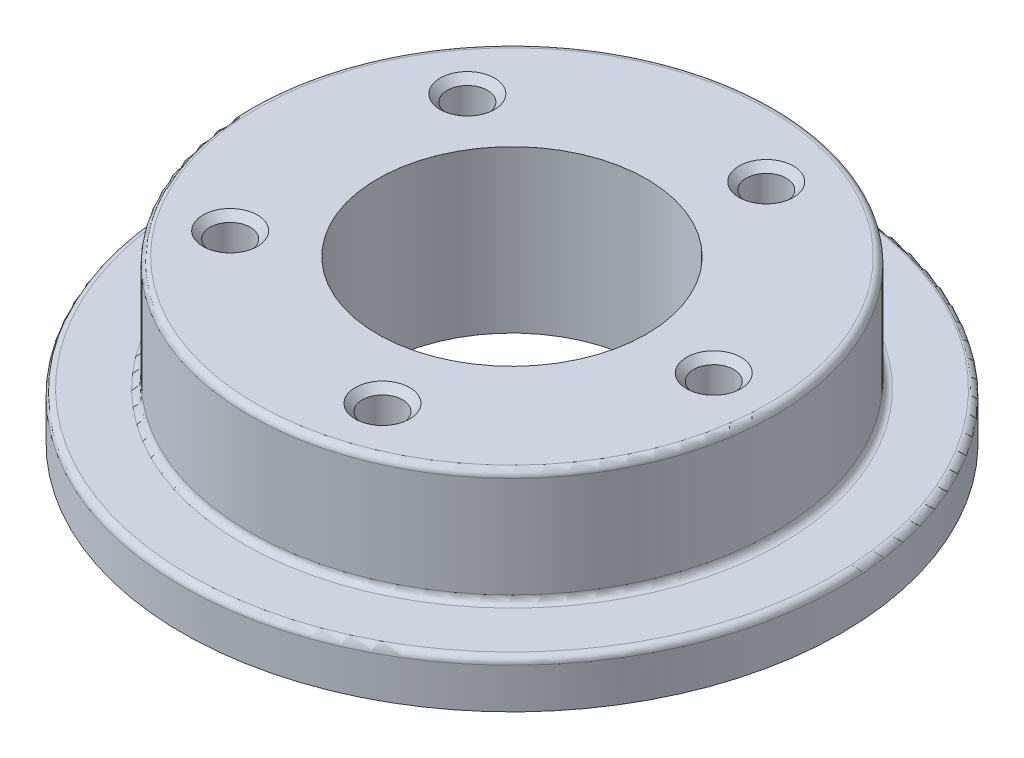
ISO-10303-21;
HEADER;
FILE_DESCRIPTION(('STEP AP214'),'2;1');
FILE_NAME('part.step','',(''),(''),'','','');
FILE_SCHEMA(('AUTOMOTIVE_DESIGN { 1 0 10303 214 1 1 1 1 }'));
ENDSEC;
DATA;
#1=APPLICATION_CONTEXT('core data for automotive mechanical design processes');
#2=APPLICATION_PROTOCOL_DEFINITION('international standard','automotive_design',2000,#1);
#3=PRODUCT_CONTEXT('',#1,'mechanical');
#4=PRODUCT('Part','Part','',(#3));
#5=PRODUCT_RELATED_PRODUCT_CATEGORY('part','',(#4));
#6=PRODUCT_DEFINITION_FORMATION('','',#4);
#7=PRODUCT_DEFINITION_CONTEXT('part definition',#1,'design');
#8=PRODUCT_DEFINITION('design','',#6,#7);
#9=PRODUCT_DEFINITION_SHAPE('','',#8);
#10=(LENGTH_UNIT() NAMED_UNIT(*) SI_UNIT(.MILLI.,.METRE.));
#11=(NAMED_UNIT(*) PLANE_ANGLE_UNIT() SI_UNIT($,.RADIAN.));
#12=(NAMED_UNIT(*) SI_UNIT($,.STERADIAN.) SOLID_ANGLE_UNIT());
#13=UNCERTAINTY_MEASURE_WITH_UNIT(LENGTH_MEASURE(1.E-05),#10,'distance_accuracy_value','');
#14=(GEOMETRIC_REPRESENTATION_CONTEXT(3) GLOBAL_UNCERTAINTY_ASSIGNED_CONTEXT((#13)) GLOBAL_UNIT_ASSIGNED_CONTEXT((#10,
#11,#12)) REPRESENTATION_CONTEXT('',''));
#15=CARTESIAN_POINT('',(0.,0.,0.));
#16=DIRECTION('',(0.,0.,1.));
#17=DIRECTION('',(1.,0.,0.));
#18=AXIS2_PLACEMENT_3D('',#15,#16,#17);
#19=CARTESIAN_POINT('',(0.,3.5,0.));
#20=DIRECTION('',(0.,1.,0.));
#21=DIRECTION('',(1.,0.,0.));
#22=AXIS2_PLACEMENT_3D('',#19,#20,#21);
#23=PLANE('',#22);
#24=CARTESIAN_POINT('',(0.,3.5,0.));
#25=DIRECTION('',(0.,1.,0.));
#26=DIRECTION('',(0.,0.,1.));
#27=AXIS2_PLACEMENT_3D('',#24,#25,#26);
#28=CIRCLE('',#27,20.);
#29=CARTESIAN_POINT('',(0.,3.5,20.));
#30=VERTEX_POINT('',#29);
#31=EDGE_CURVE('E59',#30,#30,#28,.F.);
#32=ORIENTED_EDGE('',*,*,#31,.T.);
#33=EDGE_LOOP('',(#32));
#34=FACE_BOUND('',#33,.T.);
#35=CARTESIAN_POINT('',(0.,3.5,0.));
#36=DIRECTION('',(0.,1.,0.));
#37=DIRECTION('',(0.,0.,1.));
#38=AXIS2_PLACEMENT_3D('',#35,#36,#37);
#39=CIRCLE('',#38,24.);
#40=CARTESIAN_POINT('',(0.,3.5,24.));
#41=VERTEX_POINT('',#40);
#42=EDGE_CURVE('E166',#41,#41,#39,.T.);
#43=ORIENTED_EDGE('',*,*,#42,.T.);
#44=EDGE_LOOP('',(#43));
#45=FACE_BOUND('',#44,.T.);
#46=ADVANCED_FACE('F50',(#34,#45),#23,.T.);
#47=CARTESIAN_POINT('',(0.,0.,0.));
#48=DIRECTION('',(0.,1.,0.));
#49=DIRECTION('',(1.,0.,0.));
#50=AXIS2_PLACEMENT_3D('',#47,#48,#49);
#51=PLANE('',#50);
#52=CARTESIAN_POINT('',(0.,0.,0.));
#53=DIRECTION('',(0.,1.,0.));
#54=DIRECTION('',(1.,0.,0.));
#55=AXIS2_PLACEMENT_3D('',#52,#53,#54);
#56=CIRCLE('',#55,10.);
#57=CARTESIAN_POINT('',(10.,0.,0.));
#58=VERTEX_POINT('',#57);
#59=EDGE_CURVE('E147',#58,#58,#56,.T.);
#60=ORIENTED_EDGE('',*,*,#59,.T.);
#61=EDGE_LOOP('',(#60));
#62=FACE_BOUND('',#61,.T.);
#63=CARTESIAN_POINT('',(0.,0.,0.));
#64=DIRECTION('',(0.,1.,0.));
#65=DIRECTION('',(1.,0.,0.));
#66=AXIS2_PLACEMENT_3D('',#63,#64,#65);
#67=CIRCLE('',#66,24.5);
#68=CARTESIAN_POINT('',(24.5,0.,0.));
#69=VERTEX_POINT('',#68);
#70=EDGE_CURVE('E151',#69,#69,#67,.T.);
#71=ORIENTED_EDGE('',*,*,#70,.F.);
#72=EDGE_LOOP('',(#71));
#73=FACE_BOUND('',#72,.T.);
#74=ADVANCED_FACE('F189',(#62,#73),#51,.F.);
#75=CARTESIAN_POINT('',(0.,3.5,0.));
#76=DIRECTION('',(0.,-1.,0.));
#77=DIRECTION('',(0.,0.,-1.));
#78=AXIS2_PLACEMENT_3D('',#75,#76,#77);
#79=CYLINDRICAL_SURFACE('',#78,24.5);
#80=CARTESIAN_POINT('',(0.,3.,0.));
#81=DIRECTION('',(0.,1.,0.));
#82=DIRECTION('',(0.,0.,1.));
#83=AXIS2_PLACEMENT_3D('',#80,#81,#82);
#84=CIRCLE('',#83,24.5);
#85=CARTESIAN_POINT('',(0.,3.,24.5));
#86=VERTEX_POINT('',#85);
#87=EDGE_CURVE('E12',#86,#86,#84,.F.);
#88=ORIENTED_EDGE('',*,*,#87,.T.);
#89=EDGE_LOOP('',(#88));
#90=FACE_BOUND('',#89,.T.);
#91=ORIENTED_EDGE('',*,*,#70,.T.);
#92=EDGE_LOOP('',(#91));
#93=FACE_BOUND('',#92,.T.);
#94=ADVANCED_FACE('F194',(#90,#93),#79,.T.);
#95=CARTESIAN_POINT('',(0.,3.5,0.));
#96=DIRECTION('',(0.,-1.,0.));
#97=DIRECTION('',(0.,0.,-1.));
#98=AXIS2_PLACEMENT_3D('',#95,#96,#97);
#99=CYLINDRICAL_SURFACE('',#98,10.);
#100=ORIENTED_EDGE('',*,*,#59,.F.);
#101=EDGE_LOOP('',(#100));
#102=FACE_BOUND('',#101,.T.);
#103=CARTESIAN_POINT('',(0.,12.,0.));
#104=DIRECTION('',(0.,1.,0.));
#105=DIRECTION('',(1.,0.,0.));
#106=AXIS2_PLACEMENT_3D('',#103,#104,#105);
#107=CIRCLE('',#106,10.);
#108=CARTESIAN_POINT('',(10.,12.,0.));
#109=VERTEX_POINT('',#108);
#110=EDGE_CURVE('E143',#109,#109,#107,.T.);
#111=ORIENTED_EDGE('',*,*,#110,.T.);
#112=EDGE_LOOP('',(#111));
#113=FACE_BOUND('',#112,.T.);
#114=ADVANCED_FACE('F198',(#102,#113),#99,.F.);
#115=CARTESIAN_POINT('',(0.,12.,0.));
#116=DIRECTION('',(0.,1.,0.));
#117=DIRECTION('',(1.,0.,0.));
#118=AXIS2_PLACEMENT_3D('',#115,#116,#117);
#119=PLANE('',#118);
#120=CARTESIAN_POINT('',(0.,12.,0.));
#121=DIRECTION('',(0.,1.,0.));
#122=DIRECTION('',(0.,0.,1.));
#123=AXIS2_PLACEMENT_3D('',#120,#121,#122);
#124=CIRCLE('',#123,19.);
#125=CARTESIAN_POINT('',(0.,12.,19.));
#126=VERTEX_POINT('',#125);
#127=EDGE_CURVE('E154',#126,#126,#124,.T.);
#128=ORIENTED_EDGE('',*,*,#127,.T.);
#129=EDGE_LOOP('',(#128));
#130=FACE_BOUND('',#129,.T.);
#131=CARTESIAN_POINT('',(4.63525491562437,12.,-14.2658477444273));
#132=DIRECTION('',(0.,1.,0.));
#133=DIRECTION('',(0.,0.,1.));
#134=AXIS2_PLACEMENT_3D('',#131,#132,#133);
#135=CIRCLE('',#134,2.025);
#136=CARTESIAN_POINT('',(4.63525491562437,12.,-12.2408477444273));
#137=VERTEX_POINT('',#136);
#138=EDGE_CURVE('E97',#137,#137,#135,.T.);
#139=ORIENTED_EDGE('',*,*,#138,.F.);
#140=EDGE_LOOP('',(#139));
#141=FACE_BOUND('',#140,.T.);
#142=CARTESIAN_POINT('',(-12.1352549156241,12.,-8.8167787843872));
#143=DIRECTION('',(0.,1.,0.));
#144=DIRECTION('',(0.,0.,1.));
#145=AXIS2_PLACEMENT_3D('',#142,#143,#144);
#146=CIRCLE('',#145,2.025);
#147=CARTESIAN_POINT('',(-12.1352549156241,12.,-6.7917787843872));
#148=VERTEX_POINT('',#147);
#149=EDGE_CURVE('E86',#148,#148,#146,.T.);
#150=ORIENTED_EDGE('',*,*,#149,.F.);
#151=EDGE_LOOP('',(#150));
#152=FACE_BOUND('',#151,.T.);
#153=CARTESIAN_POINT('',(-12.1352549156243,12.,8.81677878438703));
#154=DIRECTION('',(0.,1.,0.));
#155=DIRECTION('',(0.,0.,1.));
#156=AXIS2_PLACEMENT_3D('',#153,#154,#155);
#157=CIRCLE('',#156,2.025);
#158=CARTESIAN_POINT('',(-12.1352549156243,12.,10.841778784387));
#159=VERTEX_POINT('',#158);
#160=EDGE_CURVE('E108',#159,#159,#157,.T.);
#161=ORIENTED_EDGE('',*,*,#160,.F.);
#162=EDGE_LOOP('',(#161));
#163=FACE_BOUND('',#162,.T.);
#164=CARTESIAN_POINT('',(4.63525491562417,12.,14.2658477444273));
#165=DIRECTION('',(0.,1.,0.));
#166=DIRECTION('',(0.,0.,1.));
#167=AXIS2_PLACEMENT_3D('',#164,#165,#166);
#168=CIRCLE('',#167,2.025);
#169=CARTESIAN_POINT('',(4.63525491562417,12.,16.2908477444273));
#170=VERTEX_POINT('',#169);
#171=EDGE_CURVE('E120',#170,#170,#168,.T.);
#172=ORIENTED_EDGE('',*,*,#171,.F.);
#173=EDGE_LOOP('',(#172));
#174=FACE_BOUND('',#173,.T.);
#175=CARTESIAN_POINT('',(15.,12.,0.));
#176=DIRECTION('',(0.,1.,0.));
#177=DIRECTION('',(0.,0.,1.));
#178=AXIS2_PLACEMENT_3D('',#175,#176,#177);
#179=CIRCLE('',#178,2.025);
#180=CARTESIAN_POINT('',(15.,12.,2.025));
#181=VERTEX_POINT('',#180);
#182=EDGE_CURVE('E131',#181,#181,#179,.T.);
#183=ORIENTED_EDGE('',*,*,#182,.F.);
#184=EDGE_LOOP('',(#183));
#185=FACE_BOUND('',#184,.T.);
#186=ORIENTED_EDGE('',*,*,#110,.F.);
#187=EDGE_LOOP('',(#186));
#188=FACE_BOUND('',#187,.T.);
#189=ADVANCED_FACE('F206',(#130,#141,#152,#163,#174,#185,#188),#119,.T.);
#190=CARTESIAN_POINT('',(0.,12.,0.));
#191=DIRECTION('',(0.,-1.,0.));
#192=DIRECTION('',(0.,0.,-1.));
#193=AXIS2_PLACEMENT_3D('',#190,#191,#192);
#194=CYLINDRICAL_SURFACE('',#193,19.5);
#195=CARTESIAN_POINT('',(0.,11.5,0.));
#196=DIRECTION('',(0.,1.,0.));
#197=DIRECTION('',(0.,0.,1.));
#198=AXIS2_PLACEMENT_3D('',#195,#196,#197);
#199=CIRCLE('',#198,19.5);
#200=CARTESIAN_POINT('',(0.,11.5,19.5));
#201=VERTEX_POINT('',#200);
#202=EDGE_CURVE('E162',#201,#201,#199,.F.);
#203=ORIENTED_EDGE('',*,*,#202,.T.);
#204=EDGE_LOOP('',(#203));
#205=FACE_BOUND('',#204,.T.);
#206=CARTESIAN_POINT('',(0.,4.,0.));
#207=DIRECTION('',(0.,1.,0.));
#208=DIRECTION('',(0.,0.,1.));
#209=AXIS2_PLACEMENT_3D('',#206,#207,#208);
#210=CIRCLE('',#209,19.5);
#211=CARTESIAN_POINT('',(0.,4.,19.5));
#212=VERTEX_POINT('',#211);
#213=EDGE_CURVE('E158',#212,#212,#210,.T.);
#214=ORIENTED_EDGE('',*,*,#213,.T.);
#215=EDGE_LOOP('',(#214));
#216=FACE_BOUND('',#215,.T.);
#217=ADVANCED_FACE('F217',(#205,#216),#194,.T.);
#218=CARTESIAN_POINT('',(15.,2.00000000000001,0.));
#219=DIRECTION('',(0.,1.,0.));
#220=DIRECTION('',(0.,0.,1.));
#221=AXIS2_PLACEMENT_3D('',#218,#219,#220);
#222=CONICAL_SURFACE('',#221,1.49999999999999,1.02974425867665);
#223=CARTESIAN_POINT('',(15.,1.09870907145867,0.));
#224=VERTEX_POINT('',#223);
#225=VERTEX_LOOP('',#224);
#226=FACE_BOUND('',#225,.T.);
#227=CARTESIAN_POINT('',(15.,2.00000000000001,0.));
#228=DIRECTION('',(0.,1.,0.));
#229=DIRECTION('',(0.,0.,1.));
#230=AXIS2_PLACEMENT_3D('',#227,#228,#229);
#231=CIRCLE('',#230,1.49999999999999);
#232=CARTESIAN_POINT('',(15.,2.00000000000001,1.49999999999999));
#233=VERTEX_POINT('',#232);
#234=EDGE_CURVE('E139',#233,#233,#231,.T.);
#235=ORIENTED_EDGE('',*,*,#234,.T.);
#236=EDGE_LOOP('',(#235));
#237=FACE_BOUND('',#236,.T.);
#238=ADVANCED_FACE('F227',(#226,#237),#222,.F.);
#239=CARTESIAN_POINT('',(15.,12.,0.));
#240=DIRECTION('',(0.,1.,0.));
#241=DIRECTION('',(0.,0.,1.));
#242=AXIS2_PLACEMENT_3D('',#239,#240,#241);
#243=CYLINDRICAL_SURFACE('',#242,1.49999999999999);
#244=ORIENTED_EDGE('',*,*,#234,.F.);
#245=EDGE_LOOP('',(#244));
#246=FACE_BOUND('',#245,.T.);
#247=CARTESIAN_POINT('',(15.,11.475,0.));
#248=DIRECTION('',(0.,1.,0.));
#249=DIRECTION('',(0.,0.,1.));
#250=AXIS2_PLACEMENT_3D('',#247,#248,#249);
#251=CIRCLE('',#250,1.5);
#252=CARTESIAN_POINT('',(15.,11.475,1.5));
#253=VERTEX_POINT('',#252);
#254=EDGE_CURVE('E135',#253,#253,#251,.T.);
#255=ORIENTED_EDGE('',*,*,#254,.T.);
#256=EDGE_LOOP('',(#255));
#257=FACE_BOUND('',#256,.T.);
#258=ADVANCED_FACE('F233',(#246,#257),#243,.F.);
#259=CARTESIAN_POINT('',(15.,12.,0.));
#260=DIRECTION('',(0.,1.,0.));
#261=DIRECTION('',(0.,0.,1.));
#262=AXIS2_PLACEMENT_3D('',#259,#260,#261);
#263=CONICAL_SURFACE('',#262,2.025,0.78539816339745);
#264=ORIENTED_EDGE('',*,*,#254,.F.);
#265=EDGE_LOOP('',(#264));
#266=FACE_BOUND('',#265,.T.);
#267=ORIENTED_EDGE('',*,*,#182,.T.);
#268=EDGE_LOOP('',(#267));
#269=FACE_BOUND('',#268,.T.);
#270=ADVANCED_FACE('F236',(#266,#269),#263,.F.);
#271=CARTESIAN_POINT('',(4.63525491562417,2.00000000000001,14.2658477444273));
#272=DIRECTION('',(0.,1.,0.));
#273=DIRECTION('',(0.,0.,1.));
#274=AXIS2_PLACEMENT_3D('',#271,#272,#273);
#275=CONICAL_SURFACE('',#274,1.49999999999999,1.02974425867665);
#276=CARTESIAN_POINT('',(4.63525491562417,1.09870907145867,14.2658477444273));
#277=VERTEX_POINT('',#276);
#278=VERTEX_LOOP('',#277);
#279=FACE_BOUND('',#278,.T.);
#280=CARTESIAN_POINT('',(4.63525491562417,2.00000000000001,14.2658477444273));
#281=DIRECTION('',(0.,1.,0.));
#282=DIRECTION('',(0.,0.,1.));
#283=AXIS2_PLACEMENT_3D('',#280,#281,#282);
#284=CIRCLE('',#283,1.49999999999999);
#285=CARTESIAN_POINT('',(4.63525491562417,2.00000000000001,15.7658477444273));
#286=VERTEX_POINT('',#285);
#287=EDGE_CURVE('E128',#286,#286,#284,.T.);
#288=ORIENTED_EDGE('',*,*,#287,.T.);
#289=EDGE_LOOP('',(#288));
#290=FACE_BOUND('',#289,.T.);
#291=ADVANCED_FACE('F240',(#279,#290),#275,.F.);
#292=CARTESIAN_POINT('',(4.63525491562417,12.,14.2658477444273));
#293=DIRECTION('',(0.,1.,0.));
#294=DIRECTION('',(0.,0.,1.));
#295=AXIS2_PLACEMENT_3D('',#292,#293,#294);
#296=CYLINDRICAL_SURFACE('',#295,1.49999999999999);
#297=ORIENTED_EDGE('',*,*,#287,.F.);
#298=EDGE_LOOP('',(#297));
#299=FACE_BOUND('',#298,.T.);
#300=CARTESIAN_POINT('',(4.63525491562417,11.475,14.2658477444273));
#301=DIRECTION('',(0.,1.,0.));
#302=DIRECTION('',(0.,0.,1.));
#303=AXIS2_PLACEMENT_3D('',#300,#301,#302);
#304=CIRCLE('',#303,1.5);
#305=CARTESIAN_POINT('',(4.63525491562417,11.475,15.7658477444273));
#306=VERTEX_POINT('',#305);
#307=EDGE_CURVE('E124',#306,#306,#304,.T.);
#308=ORIENTED_EDGE('',*,*,#307,.T.);
#309=EDGE_LOOP('',(#308));
#310=FACE_BOUND('',#309,.T.);
#311=ADVANCED_FACE('F244',(#299,#310),#296,.F.);
#312=CARTESIAN_POINT('',(4.63525491562417,12.,14.2658477444273));
#313=DIRECTION('',(0.,1.,0.));
#314=DIRECTION('',(0.,0.,1.));
#315=AXIS2_PLACEMENT_3D('',#312,#313,#314);
#316=CONICAL_SURFACE('',#315,2.025,0.78539816339745);
#317=ORIENTED_EDGE('',*,*,#307,.F.);
#318=EDGE_LOOP('',(#317));
#319=FACE_BOUND('',#318,.T.);
#320=ORIENTED_EDGE('',*,*,#171,.T.);
#321=EDGE_LOOP('',(#320));
#322=FACE_BOUND('',#321,.T.);
#323=ADVANCED_FACE('F247',(#319,#322),#316,.F.);
#324=CARTESIAN_POINT('',(-12.1352549156243,2.00000000000001,8.81677878438703));
#325=DIRECTION('',(0.,1.,0.));
#326=DIRECTION('',(0.,0.,1.));
#327=AXIS2_PLACEMENT_3D('',#324,#325,#326);
#328=CONICAL_SURFACE('',#327,1.49999999999999,1.02974425867665);
#329=CARTESIAN_POINT('',(-12.1352549156243,1.09870907145867,8.81677878438703));
#330=VERTEX_POINT('',#329);
#331=VERTEX_LOOP('',#330);
#332=FACE_BOUND('',#331,.T.);
#333=CARTESIAN_POINT('',(-12.1352549156243,2.00000000000001,8.81677878438703));
#334=DIRECTION('',(0.,1.,0.));
#335=DIRECTION('',(0.,0.,1.));
#336=AXIS2_PLACEMENT_3D('',#333,#334,#335);
#337=CIRCLE('',#336,1.49999999999999);
#338=CARTESIAN_POINT('',(-12.1352549156243,2.00000000000001,10.316778784387));
#339=VERTEX_POINT('',#338);
#340=EDGE_CURVE('E116',#339,#339,#337,.T.);
#341=ORIENTED_EDGE('',*,*,#340,.T.);
#342=EDGE_LOOP('',(#341));
#343=FACE_BOUND('',#342,.T.);
#344=ADVANCED_FACE('F251',(#332,#343),#328,.F.);
#345=CARTESIAN_POINT('',(-12.1352549156243,12.,8.81677878438703));
#346=DIRECTION('',(0.,1.,0.));
#347=DIRECTION('',(0.,0.,1.));
#348=AXIS2_PLACEMENT_3D('',#345,#346,#347);
#349=CYLINDRICAL_SURFACE('',#348,1.49999999999999);
#350=ORIENTED_EDGE('',*,*,#340,.F.);
#351=EDGE_LOOP('',(#350));
#352=FACE_BOUND('',#351,.T.);
#353=CARTESIAN_POINT('',(-12.1352549156243,11.475,8.81677878438703));
#354=DIRECTION('',(0.,1.,0.));
#355=DIRECTION('',(0.,0.,1.));
#356=AXIS2_PLACEMENT_3D('',#353,#354,#355);
#357=CIRCLE('',#356,1.5);
#358=CARTESIAN_POINT('',(-12.1352549156243,11.475,10.316778784387));
#359=VERTEX_POINT('',#358);
#360=EDGE_CURVE('E112',#359,#359,#357,.T.);
#361=ORIENTED_EDGE('',*,*,#360,.T.);
#362=EDGE_LOOP('',(#361));
#363=FACE_BOUND('',#362,.T.);
#364=ADVANCED_FACE('F255',(#352,#363),#349,.F.);
#365=CARTESIAN_POINT('',(-12.1352549156243,12.,8.81677878438703));
#366=DIRECTION('',(0.,1.,0.));
#367=DIRECTION('',(0.,0.,1.));
#368=AXIS2_PLACEMENT_3D('',#365,#366,#367);
#369=CONICAL_SURFACE('',#368,2.025,0.78539816339745);
#370=ORIENTED_EDGE('',*,*,#360,.F.);
#371=EDGE_LOOP('',(#370));
#372=FACE_BOUND('',#371,.T.);
#373=ORIENTED_EDGE('',*,*,#160,.T.);
#374=EDGE_LOOP('',(#373));
#375=FACE_BOUND('',#374,.T.);
#376=ADVANCED_FACE('F259',(#372,#375),#369,.F.);
#377=CARTESIAN_POINT('',(-12.1352549156241,2.00000000000001,-8.8167787843872));
#378=DIRECTION('',(0.,1.,0.));
#379=DIRECTION('',(0.,0.,1.));
#380=AXIS2_PLACEMENT_3D('',#377,#378,#379);
#381=CONICAL_SURFACE('',#380,1.49999999999999,1.02974425867665);
#382=CARTESIAN_POINT('',(-12.1352549156241,1.09870907145867,-8.8167787843872));
#383=VERTEX_POINT('',#382);
#384=VERTEX_LOOP('',#383);
#385=FACE_BOUND('',#384,.T.);
#386=CARTESIAN_POINT('',(-12.1352549156241,2.00000000000001,-8.8167787843872));
#387=DIRECTION('',(0.,1.,0.));
#388=DIRECTION('',(0.,0.,1.));
#389=AXIS2_PLACEMENT_3D('',#386,#387,#388);
#390=CIRCLE('',#389,1.49999999999999);
#391=CARTESIAN_POINT('',(-12.1352549156241,2.00000000000001,-7.31677878438722));
#392=VERTEX_POINT('',#391);
#393=EDGE_CURVE('E104',#392,#392,#390,.T.);
#394=ORIENTED_EDGE('',*,*,#393,.T.);
#395=EDGE_LOOP('',(#394));
#396=FACE_BOUND('',#395,.T.);
#397=ADVANCED_FACE('F263',(#385,#396),#381,.F.);
#398=CARTESIAN_POINT('',(-12.1352549156241,12.,-8.8167787843872));
#399=DIRECTION('',(0.,1.,0.));
#400=DIRECTION('',(0.,0.,1.));
#401=AXIS2_PLACEMENT_3D('',#398,#399,#400);
#402=CYLINDRICAL_SURFACE('',#401,1.49999999999999);
#403=ORIENTED_EDGE('',*,*,#393,.F.);
#404=EDGE_LOOP('',(#403));
#405=FACE_BOUND('',#404,.T.);
#406=CARTESIAN_POINT('',(-12.1352549156241,11.475,-8.8167787843872));
#407=DIRECTION('',(0.,1.,0.));
#408=DIRECTION('',(0.,0.,1.));
#409=AXIS2_PLACEMENT_3D('',#406,#407,#408);
#410=CIRCLE('',#409,1.5);
#411=CARTESIAN_POINT('',(-12.1352549156241,11.475,-7.31677878438721));
#412=VERTEX_POINT('',#411);
#413=EDGE_CURVE('E93',#412,#412,#410,.T.);
#414=ORIENTED_EDGE('',*,*,#413,.T.);
#415=EDGE_LOOP('',(#414));
#416=FACE_BOUND('',#415,.T.);
#417=ADVANCED_FACE('F267',(#405,#416),#402,.F.);
#418=CARTESIAN_POINT('',(-12.1352549156241,12.,-8.8167787843872));
#419=DIRECTION('',(0.,1.,0.));
#420=DIRECTION('',(0.,0.,1.));
#421=AXIS2_PLACEMENT_3D('',#418,#419,#420);
#422=CONICAL_SURFACE('',#421,2.025,0.785398163397452);
#423=ORIENTED_EDGE('',*,*,#413,.F.);
#424=EDGE_LOOP('',(#423));
#425=FACE_BOUND('',#424,.T.);
#426=ORIENTED_EDGE('',*,*,#149,.T.);
#427=EDGE_LOOP('',(#426));
#428=FACE_BOUND('',#427,.T.);
#429=ADVANCED_FACE('F79',(#425,#428),#422,.F.);
#430=CARTESIAN_POINT('',(4.63525491562437,2.00000000000001,-14.2658477444273));
#431=DIRECTION('',(0.,1.,0.));
#432=DIRECTION('',(0.,0.,1.));
#433=AXIS2_PLACEMENT_3D('',#430,#431,#432);
#434=CONICAL_SURFACE('',#433,1.49999999999999,1.02974425867665);
#435=CARTESIAN_POINT('',(4.63525491562437,1.09870907145867,-14.2658477444273));
#436=VERTEX_POINT('',#435);
#437=VERTEX_LOOP('',#436);
#438=FACE_BOUND('',#437,.T.);
#439=CARTESIAN_POINT('',(4.63525491562437,2.00000000000001,-14.2658477444273));
#440=DIRECTION('',(0.,1.,0.));
#441=DIRECTION('',(0.,0.,1.));
#442=AXIS2_PLACEMENT_3D('',#439,#440,#441);
#443=CIRCLE('',#442,1.49999999999999);
#444=CARTESIAN_POINT('',(4.63525491562437,2.00000000000001,-12.7658477444273));
#445=VERTEX_POINT('',#444);
#446=EDGE_CURVE('E83',#445,#445,#443,.T.);
#447=ORIENTED_EDGE('',*,*,#446,.T.);
#448=EDGE_LOOP('',(#447));
#449=FACE_BOUND('',#448,.T.);
#450=ADVANCED_FACE('F75',(#438,#449),#434,.F.);
#451=CARTESIAN_POINT('',(4.63525491562437,12.,-14.2658477444273));
#452=DIRECTION('',(0.,1.,0.));
#453=DIRECTION('',(0.,0.,1.));
#454=AXIS2_PLACEMENT_3D('',#451,#452,#453);
#455=CYLINDRICAL_SURFACE('',#454,1.49999999999999);
#456=ORIENTED_EDGE('',*,*,#446,.F.);
#457=EDGE_LOOP('',(#456));
#458=FACE_BOUND('',#457,.T.);
#459=CARTESIAN_POINT('',(4.63525491562437,11.475,-14.2658477444273));
#460=DIRECTION('',(0.,1.,0.));
#461=DIRECTION('',(0.,0.,1.));
#462=AXIS2_PLACEMENT_3D('',#459,#460,#461);
#463=CIRCLE('',#462,1.5);
#464=CARTESIAN_POINT('',(4.63525491562437,11.475,-12.7658477444273));
#465=VERTEX_POINT('',#464);
#466=EDGE_CURVE('E87',#465,#465,#463,.T.);
#467=ORIENTED_EDGE('',*,*,#466,.T.);
#468=EDGE_LOOP('',(#467));
#469=FACE_BOUND('',#468,.T.);
#470=ADVANCED_FACE('F78',(#458,#469),#455,.F.);
#471=CARTESIAN_POINT('',(4.63525491562437,12.,-14.2658477444273));
#472=DIRECTION('',(0.,1.,0.));
#473=DIRECTION('',(0.,0.,1.));
#474=AXIS2_PLACEMENT_3D('',#471,#472,#473);
#475=CONICAL_SURFACE('',#474,2.025,0.78539816339745);
#476=ORIENTED_EDGE('',*,*,#466,.F.);
#477=EDGE_LOOP('',(#476));
#478=FACE_BOUND('',#477,.T.);
#479=ORIENTED_EDGE('',*,*,#138,.T.);
#480=EDGE_LOOP('',(#479));
#481=FACE_BOUND('',#480,.T.);
#482=ADVANCED_FACE('F184',(#478,#481),#475,.F.);
#483=CARTESIAN_POINT('',(0.,11.5,0.));
#484=DIRECTION('',(0.,1.,0.));
#485=DIRECTION('',(0.,0.,1.));
#486=AXIS2_PLACEMENT_3D('',#483,#484,#485);
#487=TOROIDAL_SURFACE('',#486,19.,0.5);
#488=ORIENTED_EDGE('',*,*,#202,.F.);
#489=EDGE_LOOP('',(#488));
#490=FACE_BOUND('',#489,.T.);
#491=ORIENTED_EDGE('',*,*,#127,.F.);
#492=EDGE_LOOP('',(#491));
#493=FACE_BOUND('',#492,.T.);
#494=ADVANCED_FACE('F177',(#490,#493),#487,.T.);
#495=CARTESIAN_POINT('',(0.,4.,0.));
#496=DIRECTION('',(0.,1.,0.));
#497=DIRECTION('',(0.,0.,1.));
#498=AXIS2_PLACEMENT_3D('',#495,#496,#497);
#499=TOROIDAL_SURFACE('',#498,20.,0.5);
#500=ORIENTED_EDGE('',*,*,#213,.F.);
#501=EDGE_LOOP('',(#500));
#502=FACE_BOUND('',#501,.T.);
#503=ORIENTED_EDGE('',*,*,#31,.F.);
#504=EDGE_LOOP('',(#503));
#505=FACE_BOUND('',#504,.T.);
#506=ADVANCED_FACE('F175',(#502,#505),#499,.F.);
#507=CARTESIAN_POINT('',(0.,3.,0.));
#508=DIRECTION('',(0.,1.,0.));
#509=DIRECTION('',(0.,0.,1.));
#510=AXIS2_PLACEMENT_3D('',#507,#508,#509);
#511=TOROIDAL_SURFACE('',#510,24.,0.5);
#512=ORIENTED_EDGE('',*,*,#87,.F.);
#513=EDGE_LOOP('',(#512));
#514=FACE_BOUND('',#513,.T.);
#515=ORIENTED_EDGE('',*,*,#42,.F.);
#516=EDGE_LOOP('',(#515));
#517=FACE_BOUND('',#516,.T.);
#518=ADVANCED_FACE('F52',(#514,#517),#511,.T.);
#519=CLOSED_SHELL('',(#46,#74,#94,#114,#189,#217,#238,#258,#270,#291,#311,#323,#344,#364,#376,
#397,#417,#429,#450,#470,#482,#494,#506,#518));
#520=MANIFOLD_SOLID_BREP('B2',#519);
#521=ADVANCED_BREP_SHAPE_REPRESENTATION('',(#18,#520),#14);
#522=SHAPE_DEFINITION_REPRESENTATION(#9,#521);
ENDSEC;
END-ISO-10303-21;
